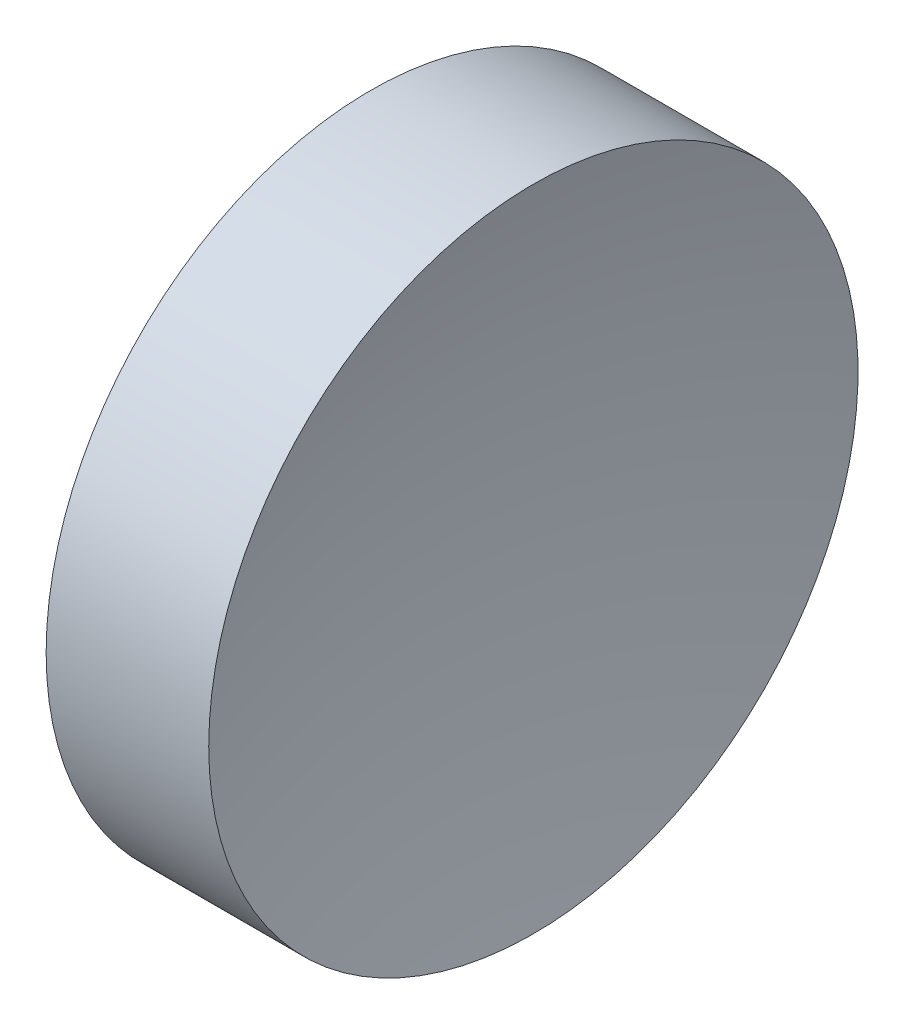
ISO-10303-21;
HEADER;
FILE_DESCRIPTION(('STEP AP214'),'2;1');
FILE_NAME('part.step','',(''),(''),'','','');
FILE_SCHEMA(('AUTOMOTIVE_DESIGN { 1 0 10303 214 1 1 1 1 }'));
ENDSEC;
DATA;
#1=APPLICATION_CONTEXT('core data for automotive mechanical design processes');
#2=APPLICATION_PROTOCOL_DEFINITION('international standard','automotive_design',2000,#1);
#3=PRODUCT_CONTEXT('',#1,'mechanical');
#4=PRODUCT('Part','Part','',(#3));
#5=PRODUCT_RELATED_PRODUCT_CATEGORY('part','',(#4));
#6=PRODUCT_DEFINITION_FORMATION('','',#4);
#7=PRODUCT_DEFINITION_CONTEXT('part definition',#1,'design');
#8=PRODUCT_DEFINITION('design','',#6,#7);
#9=PRODUCT_DEFINITION_SHAPE('','',#8);
#10=(LENGTH_UNIT() NAMED_UNIT(*) SI_UNIT(.MILLI.,.METRE.));
#11=(NAMED_UNIT(*) PLANE_ANGLE_UNIT() SI_UNIT($,.RADIAN.));
#12=(NAMED_UNIT(*) SI_UNIT($,.STERADIAN.) SOLID_ANGLE_UNIT());
#13=UNCERTAINTY_MEASURE_WITH_UNIT(LENGTH_MEASURE(1.E-05),#10,'distance_accuracy_value','');
#14=(GEOMETRIC_REPRESENTATION_CONTEXT(3) GLOBAL_UNCERTAINTY_ASSIGNED_CONTEXT((#13)) GLOBAL_UNIT_ASSIGNED_CONTEXT((#10,
#11,#12)) REPRESENTATION_CONTEXT('',''));
#15=CARTESIAN_POINT('',(0.,0.,0.));
#16=DIRECTION('',(0.,0.,1.));
#17=DIRECTION('',(1.,0.,0.));
#18=AXIS2_PLACEMENT_3D('',#15,#16,#17);
#19=CARTESIAN_POINT('',(0.,0.,0.));
#20=DIRECTION('',(1.,0.,0.));
#21=DIRECTION('',(0.,0.,-1.));
#22=AXIS2_PLACEMENT_3D('',#19,#20,#21);
#23=PLANE('',#22);
#24=CARTESIAN_POINT('',(0.,0.,0.));
#25=DIRECTION('',(-1.,0.,0.));
#26=DIRECTION('',(0.,0.,1.));
#27=AXIS2_PLACEMENT_3D('',#24,#25,#26);
#28=CIRCLE('',#27,6.35);
#29=CARTESIAN_POINT('',(0.,0.,6.35));
#30=VERTEX_POINT('',#29);
#31=EDGE_CURVE('E39',#30,#30,#28,.T.);
#32=ORIENTED_EDGE('',*,*,#31,.T.);
#33=EDGE_LOOP('',(#32));
#34=FACE_BOUND('',#33,.T.);
#35=ADVANCED_FACE('F33',(#34),#23,.F.);
#36=CARTESIAN_POINT('',(27.36,0.,0.));
#37=DIRECTION('',(-1.,0.,0.));
#38=DIRECTION('',(0.,0.,1.));
#39=AXIS2_PLACEMENT_3D('',#36,#37,#38);
#40=SPHERICAL_SURFACE('',#39,25.);
#41=CARTESIAN_POINT('',(3.17989454117291,0.,0.));
#42=DIRECTION('',(-1.,0.,0.));
#43=DIRECTION('',(0.,0.,1.));
#44=AXIS2_PLACEMENT_3D('',#41,#42,#43);
#45=CIRCLE('',#44,6.35000000000002);
#46=CARTESIAN_POINT('',(3.17989454117291,0.,6.35000000000002));
#47=VERTEX_POINT('',#46);
#48=EDGE_CURVE('E10',#47,#47,#45,.T.);
#49=ORIENTED_EDGE('',*,*,#48,.F.);
#50=EDGE_LOOP('',(#49));
#51=FACE_BOUND('',#50,.T.);
#52=ADVANCED_FACE('F48',(#51),#40,.F.);
#53=CARTESIAN_POINT('',(0.,0.,0.));
#54=DIRECTION('',(-1.,0.,0.));
#55=DIRECTION('',(0.,0.,1.));
#56=AXIS2_PLACEMENT_3D('',#53,#54,#55);
#57=CYLINDRICAL_SURFACE('',#56,6.35000000000001);
#58=ORIENTED_EDGE('',*,*,#31,.F.);
#59=EDGE_LOOP('',(#58));
#60=FACE_BOUND('',#59,.T.);
#61=ORIENTED_EDGE('',*,*,#48,.T.);
#62=EDGE_LOOP('',(#61));
#63=FACE_BOUND('',#62,.T.);
#64=ADVANCED_FACE('F46',(#60,#63),#57,.T.);
#65=CLOSED_SHELL('',(#35,#52,#64));
#66=MANIFOLD_SOLID_BREP('B2',#65);
#67=ADVANCED_BREP_SHAPE_REPRESENTATION('',(#18,#66),#14);
#68=SHAPE_DEFINITION_REPRESENTATION(#9,#67);
ENDSEC;
END-ISO-10303-21;
